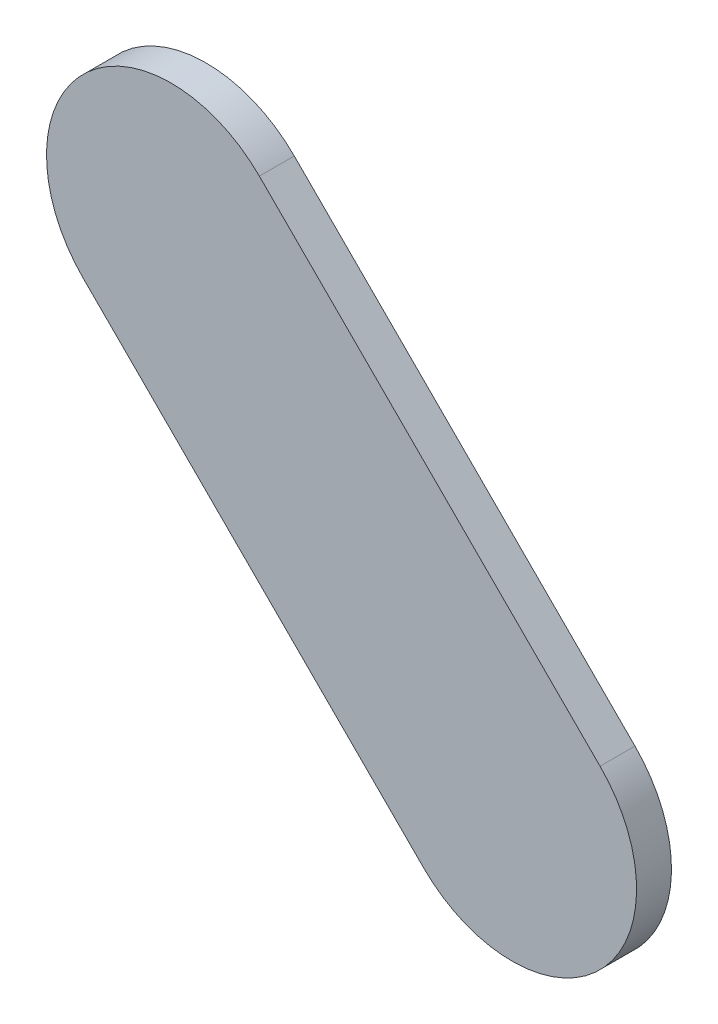
ISO-10303-21;
HEADER;
FILE_DESCRIPTION(('STEP AP214'),'2;1');
FILE_NAME('part.step','',(''),(''),'','','');
FILE_SCHEMA(('AUTOMOTIVE_DESIGN { 1 0 10303 214 1 1 1 1 }'));
ENDSEC;
DATA;
#1=APPLICATION_CONTEXT('core data for automotive mechanical design processes');
#2=APPLICATION_PROTOCOL_DEFINITION('international standard','automotive_design',2000,#1);
#3=PRODUCT_CONTEXT('',#1,'mechanical');
#4=PRODUCT('Part','Part','',(#3));
#5=PRODUCT_RELATED_PRODUCT_CATEGORY('part','',(#4));
#6=PRODUCT_DEFINITION_FORMATION('','',#4);
#7=PRODUCT_DEFINITION_CONTEXT('part definition',#1,'design');
#8=PRODUCT_DEFINITION('design','',#6,#7);
#9=PRODUCT_DEFINITION_SHAPE('','',#8);
#10=(LENGTH_UNIT() NAMED_UNIT(*) SI_UNIT(.MILLI.,.METRE.));
#11=(NAMED_UNIT(*) PLANE_ANGLE_UNIT() SI_UNIT($,.RADIAN.));
#12=(NAMED_UNIT(*) SI_UNIT($,.STERADIAN.) SOLID_ANGLE_UNIT());
#13=UNCERTAINTY_MEASURE_WITH_UNIT(LENGTH_MEASURE(1.E-05),#10,'distance_accuracy_value','');
#14=(GEOMETRIC_REPRESENTATION_CONTEXT(3) GLOBAL_UNCERTAINTY_ASSIGNED_CONTEXT((#13)) GLOBAL_UNIT_ASSIGNED_CONTEXT((#10,
#11,#12)) REPRESENTATION_CONTEXT('',''));
#15=CARTESIAN_POINT('',(0.,0.,0.));
#16=DIRECTION('',(0.,0.,1.));
#17=DIRECTION('',(1.,0.,0.));
#18=AXIS2_PLACEMENT_3D('',#15,#16,#17);
#19=CARTESIAN_POINT('',(95.4171447,88.87565664,0.));
#20=DIRECTION('',(0.707106781186562,0.707106781186533,0.));
#21=DIRECTION('',(0.707106781186533,-0.707106781186562,0.));
#22=AXIS2_PLACEMENT_3D('',#19,#20,#21);
#23=PLANE('',#22);
#24=DIRECTION('',(0.707106781186533,-0.707106781186562,0.));
#25=VECTOR('',#24,1.);
#26=CARTESIAN_POINT('',(95.4171447,88.87565664,0.03556));
#27=LINE('',#26,#25);
#28=CARTESIAN_POINT('',(95.4171447,88.87565664,0.03556));
#29=VERTEX_POINT('',#28);
#30=CARTESIAN_POINT('',(95.7641976,88.52860374,0.03556));
#31=VERTEX_POINT('',#30);
#32=EDGE_CURVE('E11',#29,#31,#27,.T.);
#33=ORIENTED_EDGE('',*,*,#32,.F.);
#34=DIRECTION('',(0.,0.,1.));
#35=VECTOR('',#34,1.);
#36=CARTESIAN_POINT('',(95.4171447,88.87565664,0.));
#37=LINE('',#36,#35);
#38=CARTESIAN_POINT('',(95.4171447,88.87565664,0.));
#39=VERTEX_POINT('',#38);
#40=EDGE_CURVE('E24',#39,#29,#37,.T.);
#41=ORIENTED_EDGE('',*,*,#40,.F.);
#42=DIRECTION('',(0.707106781186533,-0.707106781186562,0.));
#43=VECTOR('',#42,1.);
#44=CARTESIAN_POINT('',(95.4171447,88.87565664,0.));
#45=LINE('',#44,#43);
#46=CARTESIAN_POINT('',(95.7641976,88.52860374,0.));
#47=VERTEX_POINT('',#46);
#48=EDGE_CURVE('E75',#39,#47,#45,.T.);
#49=ORIENTED_EDGE('',*,*,#48,.T.);
#50=DIRECTION('',(0.,0.,1.));
#51=VECTOR('',#50,1.);
#52=CARTESIAN_POINT('',(95.7641976,88.52860374,0.));
#53=LINE('',#52,#51);
#54=EDGE_CURVE('E37',#47,#31,#53,.T.);
#55=ORIENTED_EDGE('',*,*,#54,.T.);
#56=EDGE_LOOP('',(#33,#41,#49,#55));
#57=FACE_BOUND('',#56,.T.);
#58=ADVANCED_FACE('F17',(#57),#23,.F.);
#59=CARTESIAN_POINT('',(95.85400057,88.61840671,0.));
#60=DIRECTION('',(0.,0.,-1.));
#61=DIRECTION('',(-0.707106781186548,-0.707106781186548,0.));
#62=AXIS2_PLACEMENT_3D('',#59,#60,#61);
#63=CYLINDRICAL_SURFACE('',#62,0.127000578115386);
#64=CARTESIAN_POINT('',(95.85400057,88.61840671,0.03556));
#65=DIRECTION('',(0.,0.,1.));
#66=DIRECTION('',(-0.707106781186548,-0.707106781186548,0.));
#67=AXIS2_PLACEMENT_3D('',#64,#65,#66);
#68=CIRCLE('',#67,0.127000578115386);
#69=CARTESIAN_POINT('',(95.94380354,88.70820968,0.03556));
#70=VERTEX_POINT('',#69);
#71=EDGE_CURVE('E83',#31,#70,#68,.T.);
#72=ORIENTED_EDGE('',*,*,#71,.F.);
#73=ORIENTED_EDGE('',*,*,#54,.F.);
#74=CARTESIAN_POINT('',(95.85400057,88.61840671,0.));
#75=DIRECTION('',(0.,0.,1.));
#76=DIRECTION('',(-0.707106781186548,-0.707106781186548,0.));
#77=AXIS2_PLACEMENT_3D('',#74,#75,#76);
#78=CIRCLE('',#77,0.127000578115386);
#79=CARTESIAN_POINT('',(95.94380354,88.70820968,0.));
#80=VERTEX_POINT('',#79);
#81=EDGE_CURVE('E81',#47,#80,#78,.T.);
#82=ORIENTED_EDGE('',*,*,#81,.T.);
#83=DIRECTION('',(0.,0.,1.));
#84=VECTOR('',#83,1.);
#85=CARTESIAN_POINT('',(95.94380354,88.70820968,0.));
#86=LINE('',#85,#84);
#87=EDGE_CURVE('E67',#80,#70,#86,.T.);
#88=ORIENTED_EDGE('',*,*,#87,.T.);
#89=EDGE_LOOP('',(#72,#73,#82,#88));
#90=FACE_BOUND('',#89,.T.);
#91=ADVANCED_FACE('F89',(#90),#63,.T.);
#92=CARTESIAN_POINT('',(95.94380354,88.70820968,0.));
#93=DIRECTION('',(-0.707106781186548,-0.707106781186548,0.));
#94=DIRECTION('',(-0.707106781186548,0.707106781186548,0.));
#95=AXIS2_PLACEMENT_3D('',#92,#93,#94);
#96=PLANE('',#95);
#97=DIRECTION('',(-0.707106781186548,0.707106781186548,0.));
#98=VECTOR('',#97,1.);
#99=CARTESIAN_POINT('',(95.94380354,88.70820968,0.03556));
#100=LINE('',#99,#98);
#101=CARTESIAN_POINT('',(95.59675064,89.05526258,0.03556));
#102=VERTEX_POINT('',#101);
#103=EDGE_CURVE('E71',#70,#102,#100,.T.);
#104=ORIENTED_EDGE('',*,*,#103,.F.);
#105=ORIENTED_EDGE('',*,*,#87,.F.);
#106=DIRECTION('',(-0.707106781186548,0.707106781186548,0.));
#107=VECTOR('',#106,1.);
#108=CARTESIAN_POINT('',(95.94380354,88.70820968,0.));
#109=LINE('',#108,#107);
#110=CARTESIAN_POINT('',(95.59675064,89.05526258,0.));
#111=VERTEX_POINT('',#110);
#112=EDGE_CURVE('E63',#80,#111,#109,.T.);
#113=ORIENTED_EDGE('',*,*,#112,.T.);
#114=DIRECTION('',(0.,0.,1.));
#115=VECTOR('',#114,1.);
#116=CARTESIAN_POINT('',(95.59675064,89.05526258,0.));
#117=LINE('',#116,#115);
#118=EDGE_CURVE('E53',#111,#102,#117,.T.);
#119=ORIENTED_EDGE('',*,*,#118,.T.);
#120=EDGE_LOOP('',(#104,#105,#113,#119));
#121=FACE_BOUND('',#120,.T.);
#122=ADVANCED_FACE('F66',(#121),#96,.F.);
#123=CARTESIAN_POINT('',(95.50694767,88.96545961,0.));
#124=DIRECTION('',(0.,0.,-1.));
#125=DIRECTION('',(0.707106781186604,0.707106781186492,0.));
#126=AXIS2_PLACEMENT_3D('',#123,#124,#125);
#127=CYLINDRICAL_SURFACE('',#126,0.127000578115379);
#128=CARTESIAN_POINT('',(95.50694767,88.96545961,0.03556));
#129=DIRECTION('',(0.,0.,1.));
#130=DIRECTION('',(0.707106781186604,0.707106781186492,0.));
#131=AXIS2_PLACEMENT_3D('',#128,#129,#130);
#132=CIRCLE('',#131,0.127000578115379);
#133=EDGE_CURVE('E59',#102,#29,#132,.T.);
#134=ORIENTED_EDGE('',*,*,#133,.F.);
#135=ORIENTED_EDGE('',*,*,#118,.F.);
#136=CARTESIAN_POINT('',(95.50694767,88.96545961,0.));
#137=DIRECTION('',(0.,0.,1.));
#138=DIRECTION('',(0.707106781186604,0.707106781186492,0.));
#139=AXIS2_PLACEMENT_3D('',#136,#137,#138);
#140=CIRCLE('',#139,0.127000578115379);
#141=EDGE_CURVE('E57',#111,#39,#140,.T.);
#142=ORIENTED_EDGE('',*,*,#141,.T.);
#143=ORIENTED_EDGE('',*,*,#40,.T.);
#144=EDGE_LOOP('',(#134,#135,#142,#143));
#145=FACE_BOUND('',#144,.T.);
#146=ADVANCED_FACE('F55',(#145),#127,.T.);
#147=CARTESIAN_POINT('',(95.4171447,88.87565664,0.));
#148=DIRECTION('',(0.,0.,-1.));
#149=DIRECTION('',(-1.,0.,0.));
#150=AXIS2_PLACEMENT_3D('',#147,#148,#149);
#151=PLANE('',#150);
#152=ORIENTED_EDGE('',*,*,#141,.F.);
#153=ORIENTED_EDGE('',*,*,#112,.F.);
#154=ORIENTED_EDGE('',*,*,#81,.F.);
#155=ORIENTED_EDGE('',*,*,#48,.F.);
#156=EDGE_LOOP('',(#152,#153,#154,#155));
#157=FACE_BOUND('',#156,.T.);
#158=ADVANCED_FACE('F74',(#157),#151,.T.);
#159=CARTESIAN_POINT('',(95.4171447,88.87565664,0.03556));
#160=DIRECTION('',(0.,0.,-1.));
#161=DIRECTION('',(-1.,0.,0.));
#162=AXIS2_PLACEMENT_3D('',#159,#160,#161);
#163=PLANE('',#162);
#164=ORIENTED_EDGE('',*,*,#32,.T.);
#165=ORIENTED_EDGE('',*,*,#71,.T.);
#166=ORIENTED_EDGE('',*,*,#103,.T.);
#167=ORIENTED_EDGE('',*,*,#133,.T.);
#168=EDGE_LOOP('',(#164,#165,#166,#167));
#169=FACE_BOUND('',#168,.T.);
#170=ADVANCED_FACE('F91',(#169),#163,.F.);
#171=CLOSED_SHELL('',(#58,#91,#122,#146,#158,#170));
#172=MANIFOLD_SOLID_BREP('B1',#171);
#173=ADVANCED_BREP_SHAPE_REPRESENTATION('',(#18,#172),#14);
#174=SHAPE_DEFINITION_REPRESENTATION(#9,#173);
ENDSEC;
END-ISO-10303-21;
